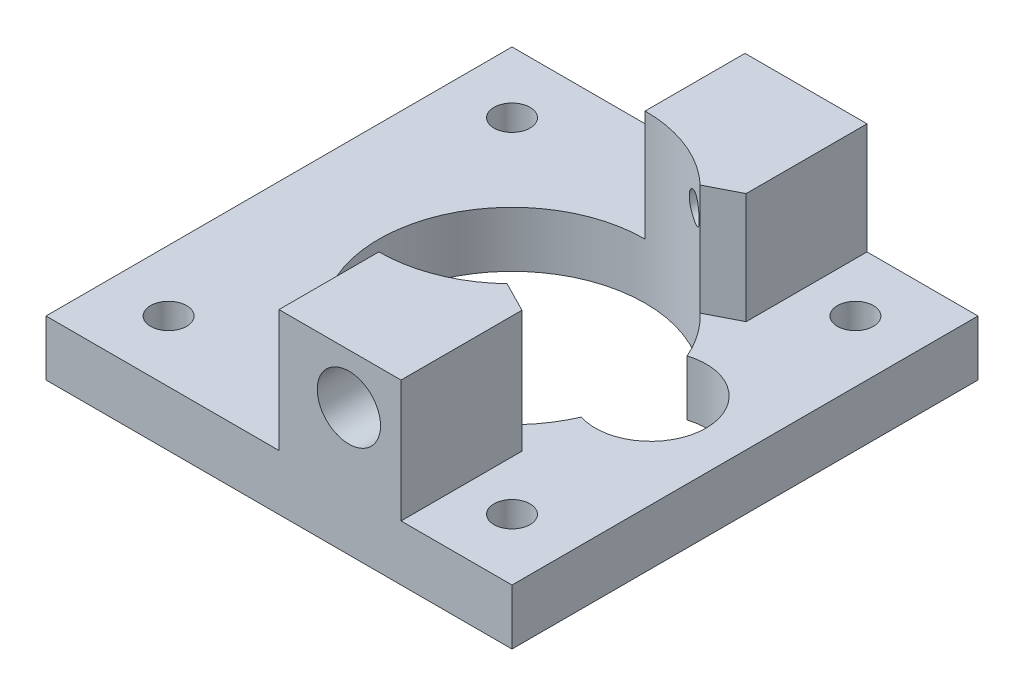
ISO-10303-21;
HEADER;
FILE_DESCRIPTION(('STEP AP214'),'2;1');
FILE_NAME('part.step','',(''),(''),'','','');
FILE_SCHEMA(('AUTOMOTIVE_DESIGN { 1 0 10303 214 1 1 1 1 }'));
ENDSEC;
DATA;
#1=APPLICATION_CONTEXT('core data for automotive mechanical design processes');
#2=APPLICATION_PROTOCOL_DEFINITION('international standard','automotive_design',2000,#1);
#3=PRODUCT_CONTEXT('',#1,'mechanical');
#4=PRODUCT('Part','Part','',(#3));
#5=PRODUCT_RELATED_PRODUCT_CATEGORY('part','',(#4));
#6=PRODUCT_DEFINITION_FORMATION('','',#4);
#7=PRODUCT_DEFINITION_CONTEXT('part definition',#1,'design');
#8=PRODUCT_DEFINITION('design','',#6,#7);
#9=PRODUCT_DEFINITION_SHAPE('','',#8);
#10=(LENGTH_UNIT() NAMED_UNIT(*) SI_UNIT(.MILLI.,.METRE.));
#11=(NAMED_UNIT(*) PLANE_ANGLE_UNIT() SI_UNIT($,.RADIAN.));
#12=(NAMED_UNIT(*) SI_UNIT($,.STERADIAN.) SOLID_ANGLE_UNIT());
#13=UNCERTAINTY_MEASURE_WITH_UNIT(LENGTH_MEASURE(1.E-05),#10,'distance_accuracy_value','');
#14=(GEOMETRIC_REPRESENTATION_CONTEXT(3) GLOBAL_UNCERTAINTY_ASSIGNED_CONTEXT((#13)) GLOBAL_UNIT_ASSIGNED_CONTEXT((#10,
#11,#12)) REPRESENTATION_CONTEXT('',''));
#15=CARTESIAN_POINT('',(0.,0.,0.));
#16=DIRECTION('',(0.,0.,1.));
#17=DIRECTION('',(1.,0.,0.));
#18=AXIS2_PLACEMENT_3D('',#15,#16,#17);
#19=CARTESIAN_POINT('',(6.29999999999999,11.5,-24.3234018715768));
#20=DIRECTION('',(0.,0.,1.));
#21=DIRECTION('',(1.,0.,0.));
#22=AXIS2_PLACEMENT_3D('',#19,#20,#21);
#23=CYLINDRICAL_SURFACE('',#22,1.175);
#24=CARTESIAN_POINT('',(7.47499999999999,11.5,9.38745838872269));
#25=CARTESIAN_POINT('',(7.47500037561036,11.4437507811066,9.3874580619095));
#26=CARTESIAN_POINT('',(7.47093573820378,11.3875033891349,9.39069895694028));
#27=CARTESIAN_POINT('',(7.45497130411184,11.2768532983478,9.40337721147673));
#28=CARTESIAN_POINT('',(7.44306841430037,11.2224513366901,9.41281701718841));
#29=CARTESIAN_POINT('',(7.4122727094978,11.1172938190168,9.43708590459081));
#30=CARTESIAN_POINT('',(7.3934163036475,11.0665208855352,9.45188690760532));
#31=CARTESIAN_POINT('',(7.34967035654355,10.9692801883149,9.48594284473265));
#32=CARTESIAN_POINT('',(7.32477888426277,10.922813809126,9.50519920432592));
#33=CARTESIAN_POINT('',(7.26754703393629,10.8309286895868,9.54904002428074));
#34=CARTESIAN_POINT('',(7.23474813129319,10.7859495130968,9.5739415629819));
#35=CARTESIAN_POINT('',(7.16425307040617,10.7020667966238,9.62680749523201));
#36=CARTESIAN_POINT('',(7.12655465793492,10.6631660715464,9.65477329769034));
#37=CARTESIAN_POINT('',(7.03878325846738,10.5840236712656,9.71900552107203));
#38=CARTESIAN_POINT('',(6.98777684641887,10.5452277036428,9.75577906113739));
#39=CARTESIAN_POINT('',(6.88120532106792,10.4768480647382,9.83124045830939));
#40=CARTESIAN_POINT('',(6.82563679981315,10.4472713609418,9.86992973777597));
#41=CARTESIAN_POINT('',(6.70095658628713,10.3930887748002,9.9550901831218));
#42=CARTESIAN_POINT('',(6.6311807374869,10.3702691876548,10.0017343169021));
#43=CARTESIAN_POINT('',(6.48849213863923,10.3379105520333,10.0948868825609));
#44=CARTESIAN_POINT('',(6.41557768507946,10.3283788118165,10.1413952257348));
#45=CARTESIAN_POINT('',(6.26346782992051,10.3229459852987,10.2360883261073));
#46=CARTESIAN_POINT('',(6.18417646096621,10.3279902907427,10.2841798593697));
#47=CARTESIAN_POINT('',(6.02651530446149,10.3544810465272,10.3773546096167));
#48=CARTESIAN_POINT('',(5.94814533403371,10.3759241842898,10.4224384321621));
#49=CARTESIAN_POINT('',(5.80015065031829,10.4338415977969,10.5054752121359));
#50=CARTESIAN_POINT('',(5.73028476847826,10.4693055306718,10.5436966289282));
#51=CARTESIAN_POINT('',(5.59724812155979,10.555010412473,10.6149186056732));
#52=CARTESIAN_POINT('',(5.53407039345135,10.6052357833348,10.6479246133816));
#53=CARTESIAN_POINT('',(5.42559337607099,10.7119361392113,10.7035586496847));
#54=CARTESIAN_POINT('',(5.37903527818813,10.7667164400501,10.7269810120016));
#55=CARTESIAN_POINT('',(5.29601113727168,10.8853022079472,10.7682134287272));
#56=CARTESIAN_POINT('',(5.25953548572142,10.9490989940849,10.7860288288007));
#57=CARTESIAN_POINT('',(5.20256881202051,11.0752044356669,10.8136098133409));
#58=CARTESIAN_POINT('',(5.18065583205767,11.1367152047945,10.8241000187399));
#59=CARTESIAN_POINT('',(5.14727165776517,11.2631293850674,10.8400157901539));
#60=CARTESIAN_POINT('',(5.13579489757456,11.3280309682643,10.8454440558497));
#61=CARTESIAN_POINT('',(5.12431187336805,11.4542016958921,10.8508738266164));
#62=CARTESIAN_POINT('',(5.12352079158136,11.5153849429973,10.8512466416488));
#63=CARTESIAN_POINT('',(5.1314244088291,11.6369895552123,10.8475113631404));
#64=CARTESIAN_POINT('',(5.14011738312642,11.6974110568294,10.8434040843336));
#65=CARTESIAN_POINT('',(5.16635680326296,11.8146831225682,10.830926125749));
#66=CARTESIAN_POINT('',(5.18374253977507,11.8715781616229,10.8226328106716));
#67=CARTESIAN_POINT('',(5.22655249370738,11.9814705824725,10.8020234252775));
#68=CARTESIAN_POINT('',(5.25197734535867,12.0344676563379,10.7897070375654));
#69=CARTESIAN_POINT('',(5.31081754299332,12.1369839659528,10.760869867597));
#70=CARTESIAN_POINT('',(5.34446540274296,12.1863345456327,10.7442256247938));
#71=CARTESIAN_POINT('',(5.41801128430791,12.2785914170407,10.7073266631582));
#72=CARTESIAN_POINT('',(5.45791094645002,12.3214960116896,10.6870709965797));
#73=CARTESIAN_POINT('',(5.5458824479816,12.4032195877325,10.6417016657962));
#74=CARTESIAN_POINT('',(5.59434585376875,12.4414754579763,10.6163349930468));
#75=CARTESIAN_POINT('',(5.69539029755836,12.5093470994993,10.5624718108427));
#76=CARTESIAN_POINT('',(5.7479730046778,12.538959345224,10.5339740307792));
#77=CARTESIAN_POINT('',(5.861787789188,12.5922303701135,10.4711086657003));
#78=CARTESIAN_POINT('',(5.92333248507643,12.6148651636975,10.4364405919522));
#79=CARTESIAN_POINT('',(6.04798325514781,12.6494793565939,10.3647035942875));
#80=CARTESIAN_POINT('',(6.11109001376997,12.6614539969245,10.3276336060051));
#81=CARTESIAN_POINT('',(6.24527726801485,12.6758960448265,10.2471147256045));
#82=CARTESIAN_POINT('',(6.31637362694875,12.676996298013,10.2034457741675));
#83=CARTESIAN_POINT('',(6.45699899992309,12.6665996443551,10.1150421556888));
#84=CARTESIAN_POINT('',(6.52652678414533,12.6550931813017,10.0703067053755));
#85=CARTESIAN_POINT('',(6.66896315293066,12.6182164668137,9.97661584742794));
#86=CARTESIAN_POINT('',(6.74156243395978,12.5916294562665,9.92766458504591));
#87=CARTESIAN_POINT('',(6.88108424791014,12.5241904245393,9.83147247575013));
#88=CARTESIAN_POINT('',(6.94800847972649,12.4833426913512,9.78423111939978));
#89=CARTESIAN_POINT('',(7.06257134243327,12.3962763712551,9.70175980896785));
#90=CARTESIAN_POINT('',(7.11150991723543,12.3523609323869,9.66590165456406));
#91=CARTESIAN_POINT('',(7.20254937585845,12.2552773262606,9.59825435036645));
#92=CARTESIAN_POINT('',(7.24465954943328,12.202121937199,9.56645968506354));
#93=CARTESIAN_POINT('',(7.3129439340035,12.0980551337812,9.51432274903214));
#94=CARTESIAN_POINT('',(7.34062571839081,12.0486510161587,9.49295284776069));
#95=CARTESIAN_POINT('',(7.38907936431073,11.9447553828823,9.45528686398682));
#96=CARTESIAN_POINT('',(7.40985679890421,11.8902680160581,9.43898668998012));
#97=CARTESIAN_POINT('',(7.4423551682127,11.7805915378061,9.41338187443222));
#98=CARTESIAN_POINT('',(7.45452247020002,11.7256170381544,9.40373324996186));
#99=CARTESIAN_POINT('',(7.47084265218716,11.6137604108939,9.39077328860187));
#100=CARTESIAN_POINT('',(7.47499962018238,11.556879271408,9.38745871919654));
#101=CARTESIAN_POINT('',(7.47499999999999,11.5,9.38745838872269));
#102=B_SPLINE_CURVE_WITH_KNOTS('',3,(#24,#25,#26,#27,#28,#29,#30,#31,#32,#33,#34,#35,#36,#37,
#38,#39,#40,#41,#42,#43,#44,#45,#46,#47,#48,#49,#50,#51,#52,#53,#54,#55,#56,#57,#58,#59,#60,#61,
#62,#63,#64,#65,#66,#67,#68,#69,#70,#71,#72,#73,#74,#75,#76,#77,#78,#79,#80,#81,#82,#83,#84,#85,
#86,#87,#88,#89,#90,#91,#92,#93,#94,#95,#96,#97,#98,#99,#100,#101),.UNSPECIFIED.,.T.,.F.,(4,2,2,
2,2,2,2,2,2,2,2,2,2,2,2,2,2,2,2,2,2,2,2,2,2,2,2,2,2,2,2,2,2,2,2,2,2,2,4),(0.,0.168514893419252,
0.33709632595878,0.504807304613788,0.672572016369988,0.854871808167711,1.03725577362463,
1.25808340076039,1.47907751663057,1.73889849392279,1.99886231534371,2.27605791252218,
2.55319753074216,2.81321741213452,3.07296386824326,3.29849562970217,3.52381171372948,
3.72116542539341,3.91841382223322,4.1010890920136,4.28373114664802,4.46311493239954,
4.64251287383508,4.82773212730998,5.01300005961671,5.21243182482231,5.41194482079294,
5.63357664929254,5.85530737071217,6.10460617034262,6.35409407557854,6.62735909341052,
6.90054201508986,7.12437632663873,7.34790351870778,7.52877745664265,7.70950503988488,
7.87999451434449,8.05039695810545),.UNSPECIFIED.);
#103=CARTESIAN_POINT('',(7.47499999999999,11.5,9.38745838872269));
#104=VERTEX_POINT('',#103);
#105=EDGE_CURVE('E217',#104,#104,#102,.T.);
#106=ORIENTED_EDGE('',*,*,#105,.T.);
#107=EDGE_LOOP('',(#106));
#108=FACE_BOUND('',#107,.T.);
#109=CARTESIAN_POINT('',(6.29999999999999,11.5,16.));
#110=DIRECTION('',(0.,0.,1.));
#111=DIRECTION('',(1.,0.,0.));
#112=AXIS2_PLACEMENT_3D('',#109,#110,#111);
#113=CIRCLE('',#112,1.175);
#114=CARTESIAN_POINT('',(7.47499999999999,11.5,16.));
#115=VERTEX_POINT('',#114);
#116=EDGE_CURVE('E51',#115,#115,#113,.F.);
#117=ORIENTED_EDGE('',*,*,#116,.F.);
#118=EDGE_LOOP('',(#117));
#119=FACE_BOUND('',#118,.T.);
#120=ADVANCED_FACE('F47',(#108,#119),#23,.F.);
#121=CARTESIAN_POINT('',(0.,5.,0.));
#122=DIRECTION('',(0.,1.,0.));
#123=DIRECTION('',(0.,0.,1.));
#124=AXIS2_PLACEMENT_3D('',#121,#122,#123);
#125=PLANE('',#124);
#126=CARTESIAN_POINT('',(-15.475,5.,15.475));
#127=DIRECTION('',(0.,1.,0.));
#128=DIRECTION('',(0.,0.,-1.));
#129=AXIS2_PLACEMENT_3D('',#126,#127,#128);
#130=CIRCLE('',#129,1.625);
#131=CARTESIAN_POINT('',(-15.475,5.,13.85));
#132=VERTEX_POINT('',#131);
#133=EDGE_CURVE('E286',#132,#132,#130,.T.);
#134=ORIENTED_EDGE('',*,*,#133,.F.);
#135=EDGE_LOOP('',(#134));
#136=FACE_BOUND('',#135,.T.);
#137=CARTESIAN_POINT('',(-15.475,5.,-15.475));
#138=DIRECTION('',(0.,1.,0.));
#139=DIRECTION('',(0.,0.,1.));
#140=AXIS2_PLACEMENT_3D('',#137,#138,#139);
#141=CIRCLE('',#140,1.625);
#142=CARTESIAN_POINT('',(-15.475,5.,-13.85));
#143=VERTEX_POINT('',#142);
#144=EDGE_CURVE('E291',#143,#143,#141,.T.);
#145=ORIENTED_EDGE('',*,*,#144,.F.);
#146=EDGE_LOOP('',(#145));
#147=FACE_BOUND('',#146,.T.);
#148=DIRECTION('',(1.,0.,0.));
#149=VECTOR('',#148,1.);
#150=CARTESIAN_POINT('',(-21.,5.,21.));
#151=LINE('',#150,#149);
#152=CARTESIAN_POINT('',(-21.,5.,21.));
#153=VERTEX_POINT('',#152);
#154=CARTESIAN_POINT('',(0.,5.,21.0000000000001));
#155=VERTEX_POINT('',#154);
#156=EDGE_CURVE('E328',#153,#155,#151,.T.);
#157=ORIENTED_EDGE('',*,*,#156,.T.);
#158=DIRECTION('',(0.,0.,1.));
#159=VECTOR('',#158,1.);
#160=CARTESIAN_POINT('',(0.,5.,12.0000000000001));
#161=LINE('',#160,#159);
#162=CARTESIAN_POINT('',(0.,5.,12.));
#163=VERTEX_POINT('',#162);
#164=EDGE_CURVE('E168',#163,#155,#161,.T.);
#165=ORIENTED_EDGE('',*,*,#164,.F.);
#166=CARTESIAN_POINT('',(0.,5.,0.));
#167=DIRECTION('',(0.,1.,0.));
#168=DIRECTION('',(0.,0.,1.));
#169=AXIS2_PLACEMENT_3D('',#166,#167,#168);
#170=CIRCLE('',#169,12.);
#171=CARTESIAN_POINT('',(0.,5.,-12.));
#172=VERTEX_POINT('',#171);
#173=EDGE_CURVE('E303',#172,#163,#170,.T.);
#174=ORIENTED_EDGE('',*,*,#173,.F.);
#175=DIRECTION('',(0.,0.,1.));
#176=VECTOR('',#175,1.);
#177=CARTESIAN_POINT('',(0.,5.,-12.));
#178=LINE('',#177,#176);
#179=CARTESIAN_POINT('',(0.,5.,-21.));
#180=VERTEX_POINT('',#179);
#181=EDGE_CURVE('E244',#180,#172,#178,.T.);
#182=ORIENTED_EDGE('',*,*,#181,.F.);
#183=DIRECTION('',(-1.,0.,0.));
#184=VECTOR('',#183,1.);
#185=CARTESIAN_POINT('',(-21.,5.,-21.));
#186=LINE('',#185,#184);
#187=CARTESIAN_POINT('',(-21.,5.,-21.));
#188=VERTEX_POINT('',#187);
#189=EDGE_CURVE('E319',#180,#188,#186,.T.);
#190=ORIENTED_EDGE('',*,*,#189,.T.);
#191=DIRECTION('',(0.,0.,1.));
#192=VECTOR('',#191,1.);
#193=CARTESIAN_POINT('',(-21.,5.,-21.));
#194=LINE('',#193,#192);
#195=EDGE_CURVE('E324',#188,#153,#194,.T.);
#196=ORIENTED_EDGE('',*,*,#195,.T.);
#197=EDGE_LOOP('',(#157,#165,#174,#182,#190,#196));
#198=FACE_BOUND('',#197,.T.);
#199=ADVANCED_FACE('F392',(#136,#147,#198),#125,.T.);
#200=CARTESIAN_POINT('',(12.5,5.,0.));
#201=DIRECTION('',(0.,1.,0.));
#202=DIRECTION('',(0.,0.,1.));
#203=AXIS2_PLACEMENT_3D('',#200,#201,#202);
#204=CIRCLE('',#203,5.);
#205=CARTESIAN_POINT('',(11.01,5.,4.77282934955777));
#206=VERTEX_POINT('',#205);
#207=CARTESIAN_POINT('',(11.01,5.,-4.77282934955777));
#208=VERTEX_POINT('',#207);
#209=EDGE_CURVE('E63',#206,#208,#204,.T.);
#210=ORIENTED_EDGE('',*,*,#209,.F.);
#211=CARTESIAN_POINT('',(8.26040454762493,5.,8.70435044730951));
#212=VERTEX_POINT('',#211);
#213=EDGE_CURVE('E308',#212,#206,#170,.T.);
#214=ORIENTED_EDGE('',*,*,#213,.F.);
#215=DIRECTION('',(-0.890650513292519,0.,-0.454688534242696));
#216=VECTOR('',#215,1.);
#217=CARTESIAN_POINT('',(8.26040454762496,5.,8.70435044730954));
#218=LINE('',#217,#216);
#219=CARTESIAN_POINT('',(11.,5.,10.1029491367702));
#220=VERTEX_POINT('',#219);
#221=EDGE_CURVE('E230',#220,#212,#218,.T.);
#222=ORIENTED_EDGE('',*,*,#221,.F.);
#223=DIRECTION('',(0.,0.,-1.));
#224=VECTOR('',#223,1.);
#225=CARTESIAN_POINT('',(11.,5.,21.));
#226=LINE('',#225,#224);
#227=CARTESIAN_POINT('',(11.,5.,21.));
#228=VERTEX_POINT('',#227);
#229=EDGE_CURVE('E233',#228,#220,#226,.T.);
#230=ORIENTED_EDGE('',*,*,#229,.F.);
#231=CARTESIAN_POINT('',(21.,5.,21.));
#232=VERTEX_POINT('',#231);
#233=EDGE_CURVE('E327',#228,#232,#151,.T.);
#234=ORIENTED_EDGE('',*,*,#233,.T.);
#235=DIRECTION('',(0.,0.,-1.));
#236=VECTOR('',#235,1.);
#237=CARTESIAN_POINT('',(21.,5.,-21.));
#238=LINE('',#237,#236);
#239=CARTESIAN_POINT('',(21.,5.,-21.));
#240=VERTEX_POINT('',#239);
#241=EDGE_CURVE('E315',#232,#240,#238,.T.);
#242=ORIENTED_EDGE('',*,*,#241,.T.);
#243=CARTESIAN_POINT('',(11.,5.,-21.));
#244=VERTEX_POINT('',#243);
#245=EDGE_CURVE('E321',#240,#244,#186,.T.);
#246=ORIENTED_EDGE('',*,*,#245,.T.);
#247=DIRECTION('',(0.,0.,-1.));
#248=VECTOR('',#247,1.);
#249=CARTESIAN_POINT('',(11.,5.,-21.));
#250=LINE('',#249,#248);
#251=CARTESIAN_POINT('',(11.,5.,-10.1029491367702));
#252=VERTEX_POINT('',#251);
#253=EDGE_CURVE('E260',#252,#244,#250,.T.);
#254=ORIENTED_EDGE('',*,*,#253,.F.);
#255=DIRECTION('',(0.890650513292519,0.,-0.454688534242698));
#256=VECTOR('',#255,1.);
#257=CARTESIAN_POINT('',(8.26040454762493,5.,-8.70435044730952));
#258=LINE('',#257,#256);
#259=CARTESIAN_POINT('',(8.26040454762493,5.,-8.70435044730952));
#260=VERTEX_POINT('',#259);
#261=EDGE_CURVE('E238',#260,#252,#258,.T.);
#262=ORIENTED_EDGE('',*,*,#261,.F.);
#263=EDGE_CURVE('E309',#208,#260,#170,.T.);
#264=ORIENTED_EDGE('',*,*,#263,.F.);
#265=EDGE_LOOP('',(#210,#214,#222,#230,#234,#242,#246,#254,#262,#264));
#266=FACE_BOUND('',#265,.T.);
#267=CARTESIAN_POINT('',(15.475,5.,-15.475));
#268=DIRECTION('',(0.,1.,0.));
#269=DIRECTION('',(0.,0.,-1.));
#270=AXIS2_PLACEMENT_3D('',#267,#268,#269);
#271=CIRCLE('',#270,1.625);
#272=CARTESIAN_POINT('',(15.475,5.,-17.1));
#273=VERTEX_POINT('',#272);
#274=EDGE_CURVE('E287',#273,#273,#271,.T.);
#275=ORIENTED_EDGE('',*,*,#274,.F.);
#276=EDGE_LOOP('',(#275));
#277=FACE_BOUND('',#276,.T.);
#278=CARTESIAN_POINT('',(15.475,5.,15.475));
#279=DIRECTION('',(0.,1.,0.));
#280=DIRECTION('',(0.,0.,1.));
#281=AXIS2_PLACEMENT_3D('',#278,#279,#280);
#282=CIRCLE('',#281,1.625);
#283=CARTESIAN_POINT('',(15.475,5.,17.1));
#284=VERTEX_POINT('',#283);
#285=EDGE_CURVE('E292',#284,#284,#282,.T.);
#286=ORIENTED_EDGE('',*,*,#285,.F.);
#287=EDGE_LOOP('',(#286));
#288=FACE_BOUND('',#287,.T.);
#289=ADVANCED_FACE('F449',(#266,#277,#288),#125,.T.);
#290=CARTESIAN_POINT('',(0.,0.,0.));
#291=DIRECTION('',(0.,1.,0.));
#292=DIRECTION('',(0.,0.,1.));
#293=AXIS2_PLACEMENT_3D('',#290,#291,#292);
#294=PLANE('',#293);
#295=CARTESIAN_POINT('',(-15.475,0.,15.475));
#296=DIRECTION('',(0.,1.,0.));
#297=DIRECTION('',(0.,0.,1.));
#298=AXIS2_PLACEMENT_3D('',#295,#296,#297);
#299=CIRCLE('',#298,1.625);
#300=CARTESIAN_POINT('',(-15.475,0.,17.1));
#301=VERTEX_POINT('',#300);
#302=EDGE_CURVE('E314',#301,#301,#299,.T.);
#303=ORIENTED_EDGE('',*,*,#302,.T.);
#304=EDGE_LOOP('',(#303));
#305=FACE_BOUND('',#304,.T.);
#306=CARTESIAN_POINT('',(15.475,0.,15.475));
#307=DIRECTION('',(0.,1.,0.));
#308=DIRECTION('',(0.,0.,1.));
#309=AXIS2_PLACEMENT_3D('',#306,#307,#308);
#310=CIRCLE('',#309,1.625);
#311=CARTESIAN_POINT('',(15.475,0.,17.1));
#312=VERTEX_POINT('',#311);
#313=EDGE_CURVE('E365',#312,#312,#310,.T.);
#314=ORIENTED_EDGE('',*,*,#313,.T.);
#315=EDGE_LOOP('',(#314));
#316=FACE_BOUND('',#315,.T.);
#317=CARTESIAN_POINT('',(15.475,0.,-15.475));
#318=DIRECTION('',(0.,1.,0.));
#319=DIRECTION('',(0.,0.,1.));
#320=AXIS2_PLACEMENT_3D('',#317,#318,#319);
#321=CIRCLE('',#320,1.625);
#322=CARTESIAN_POINT('',(15.475,0.,-13.85));
#323=VERTEX_POINT('',#322);
#324=EDGE_CURVE('E361',#323,#323,#321,.T.);
#325=ORIENTED_EDGE('',*,*,#324,.T.);
#326=EDGE_LOOP('',(#325));
#327=FACE_BOUND('',#326,.T.);
#328=CARTESIAN_POINT('',(-15.475,0.,-15.475));
#329=DIRECTION('',(0.,1.,0.));
#330=DIRECTION('',(0.,0.,1.));
#331=AXIS2_PLACEMENT_3D('',#328,#329,#330);
#332=CIRCLE('',#331,1.625);
#333=CARTESIAN_POINT('',(-15.475,0.,-13.85));
#334=VERTEX_POINT('',#333);
#335=EDGE_CURVE('E302',#334,#334,#332,.T.);
#336=ORIENTED_EDGE('',*,*,#335,.T.);
#337=EDGE_LOOP('',(#336));
#338=FACE_BOUND('',#337,.T.);
#339=DIRECTION('',(0.,0.,-1.));
#340=VECTOR('',#339,1.);
#341=CARTESIAN_POINT('',(21.,0.,-21.));
#342=LINE('',#341,#340);
#343=CARTESIAN_POINT('',(21.,0.,21.));
#344=VERTEX_POINT('',#343);
#345=CARTESIAN_POINT('',(21.,0.,-21.));
#346=VERTEX_POINT('',#345);
#347=EDGE_CURVE('E307',#344,#346,#342,.T.);
#348=ORIENTED_EDGE('',*,*,#347,.F.);
#349=DIRECTION('',(1.,0.,0.));
#350=VECTOR('',#349,1.);
#351=CARTESIAN_POINT('',(-21.,0.,21.));
#352=LINE('',#351,#350);
#353=CARTESIAN_POINT('',(-21.,0.,21.));
#354=VERTEX_POINT('',#353);
#355=EDGE_CURVE('E320',#354,#344,#352,.T.);
#356=ORIENTED_EDGE('',*,*,#355,.F.);
#357=DIRECTION('',(0.,0.,1.));
#358=VECTOR('',#357,1.);
#359=CARTESIAN_POINT('',(-21.,0.,-21.));
#360=LINE('',#359,#358);
#361=CARTESIAN_POINT('',(-21.,0.,-21.));
#362=VERTEX_POINT('',#361);
#363=EDGE_CURVE('E338',#362,#354,#360,.T.);
#364=ORIENTED_EDGE('',*,*,#363,.F.);
#365=DIRECTION('',(-1.,0.,0.));
#366=VECTOR('',#365,1.);
#367=CARTESIAN_POINT('',(-21.,0.,-21.));
#368=LINE('',#367,#366);
#369=EDGE_CURVE('E335',#346,#362,#368,.T.);
#370=ORIENTED_EDGE('',*,*,#369,.F.);
#371=EDGE_LOOP('',(#348,#356,#364,#370));
#372=FACE_BOUND('',#371,.T.);
#373=CARTESIAN_POINT('',(0.,0.,0.));
#374=DIRECTION('',(0.,1.,0.));
#375=DIRECTION('',(0.,0.,1.));
#376=AXIS2_PLACEMENT_3D('',#373,#374,#375);
#377=CIRCLE('',#376,12.);
#378=CARTESIAN_POINT('',(11.01,0.,-4.77282934955776));
#379=VERTEX_POINT('',#378);
#380=CARTESIAN_POINT('',(11.01,0.,4.77282934955776));
#381=VERTEX_POINT('',#380);
#382=EDGE_CURVE('E310',#379,#381,#377,.T.);
#383=ORIENTED_EDGE('',*,*,#382,.T.);
#384=CARTESIAN_POINT('',(12.5,0.,0.));
#385=DIRECTION('',(0.,1.,0.));
#386=DIRECTION('',(0.,0.,1.));
#387=AXIS2_PLACEMENT_3D('',#384,#385,#386);
#388=CIRCLE('',#387,5.);
#389=EDGE_CURVE('E210',#381,#379,#388,.T.);
#390=ORIENTED_EDGE('',*,*,#389,.T.);
#391=EDGE_LOOP('',(#383,#390));
#392=FACE_BOUND('',#391,.T.);
#393=ADVANCED_FACE('F446',(#305,#316,#327,#338,#372,#392),#294,.F.);
#394=CARTESIAN_POINT('',(21.,5.,-21.));
#395=DIRECTION('',(-1.,0.,0.));
#396=DIRECTION('',(0.,0.,1.));
#397=AXIS2_PLACEMENT_3D('',#394,#395,#396);
#398=PLANE('',#397);
#399=ORIENTED_EDGE('',*,*,#347,.T.);
#400=DIRECTION('',(0.,-1.,0.));
#401=VECTOR('',#400,1.);
#402=CARTESIAN_POINT('',(21.,5.,-21.));
#403=LINE('',#402,#401);
#404=EDGE_CURVE('E354',#240,#346,#403,.T.);
#405=ORIENTED_EDGE('',*,*,#404,.F.);
#406=ORIENTED_EDGE('',*,*,#241,.F.);
#407=DIRECTION('',(0.,-1.,0.));
#408=VECTOR('',#407,1.);
#409=CARTESIAN_POINT('',(21.,5.,21.));
#410=LINE('',#409,#408);
#411=EDGE_CURVE('E331',#232,#344,#410,.T.);
#412=ORIENTED_EDGE('',*,*,#411,.T.);
#413=EDGE_LOOP('',(#399,#405,#406,#412));
#414=FACE_BOUND('',#413,.T.);
#415=ADVANCED_FACE('F49',(#414),#398,.F.);
#416=CARTESIAN_POINT('',(-21.,5.,-21.));
#417=DIRECTION('',(0.,0.,1.));
#418=DIRECTION('',(1.,0.,0.));
#419=AXIS2_PLACEMENT_3D('',#416,#417,#418);
#420=PLANE('',#419);
#421=CARTESIAN_POINT('',(6.29999999999999,11.5,-21.));
#422=DIRECTION('',(0.,0.,1.));
#423=DIRECTION('',(1.,0.,0.));
#424=AXIS2_PLACEMENT_3D('',#421,#422,#423);
#425=CIRCLE('',#424,1.175);
#426=CARTESIAN_POINT('',(7.47499999999999,11.5,-21.));
#427=VERTEX_POINT('',#426);
#428=EDGE_CURVE('E214',#427,#427,#425,.F.);
#429=ORIENTED_EDGE('',*,*,#428,.F.);
#430=EDGE_LOOP('',(#429));
#431=FACE_BOUND('',#430,.T.);
#432=ORIENTED_EDGE('',*,*,#369,.T.);
#433=DIRECTION('',(0.,-1.,0.));
#434=VECTOR('',#433,1.);
#435=CARTESIAN_POINT('',(-21.,5.,-21.));
#436=LINE('',#435,#434);
#437=EDGE_CURVE('E350',#188,#362,#436,.T.);
#438=ORIENTED_EDGE('',*,*,#437,.F.);
#439=ORIENTED_EDGE('',*,*,#189,.F.);
#440=DIRECTION('',(0.,-1.,0.));
#441=VECTOR('',#440,1.);
#442=CARTESIAN_POINT('',(0.,15.,-21.));
#443=LINE('',#442,#441);
#444=CARTESIAN_POINT('',(0.,15.,-21.));
#445=VERTEX_POINT('',#444);
#446=EDGE_CURVE('E270',#445,#180,#443,.T.);
#447=ORIENTED_EDGE('',*,*,#446,.F.);
#448=DIRECTION('',(-1.,0.,0.));
#449=VECTOR('',#448,1.);
#450=CARTESIAN_POINT('',(0.,15.,-21.));
#451=LINE('',#450,#449);
#452=CARTESIAN_POINT('',(11.,15.,-21.));
#453=VERTEX_POINT('',#452);
#454=EDGE_CURVE('E250',#453,#445,#451,.T.);
#455=ORIENTED_EDGE('',*,*,#454,.F.);
#456=DIRECTION('',(0.,-1.,0.));
#457=VECTOR('',#456,1.);
#458=CARTESIAN_POINT('',(11.,15.,-21.));
#459=LINE('',#458,#457);
#460=EDGE_CURVE('E274',#453,#244,#459,.T.);
#461=ORIENTED_EDGE('',*,*,#460,.T.);
#462=ORIENTED_EDGE('',*,*,#245,.F.);
#463=ORIENTED_EDGE('',*,*,#404,.T.);
#464=EDGE_LOOP('',(#432,#438,#439,#447,#455,#461,#462,#463));
#465=FACE_BOUND('',#464,.T.);
#466=ADVANCED_FACE('F476',(#431,#465),#420,.F.);
#467=CARTESIAN_POINT('',(-21.,5.,-21.));
#468=DIRECTION('',(1.,0.,0.));
#469=DIRECTION('',(0.,0.,-1.));
#470=AXIS2_PLACEMENT_3D('',#467,#468,#469);
#471=PLANE('',#470);
#472=ORIENTED_EDGE('',*,*,#363,.T.);
#473=DIRECTION('',(0.,-1.,0.));
#474=VECTOR('',#473,1.);
#475=CARTESIAN_POINT('',(-21.,5.,21.));
#476=LINE('',#475,#474);
#477=EDGE_CURVE('E346',#153,#354,#476,.T.);
#478=ORIENTED_EDGE('',*,*,#477,.F.);
#479=ORIENTED_EDGE('',*,*,#195,.F.);
#480=ORIENTED_EDGE('',*,*,#437,.T.);
#481=EDGE_LOOP('',(#472,#478,#479,#480));
#482=FACE_BOUND('',#481,.T.);
#483=ADVANCED_FACE('F492',(#482),#471,.F.);
#484=CARTESIAN_POINT('',(-21.,5.,21.));
#485=DIRECTION('',(0.,0.,-1.));
#486=DIRECTION('',(-1.,0.,0.));
#487=AXIS2_PLACEMENT_3D('',#484,#485,#486);
#488=PLANE('',#487);
#489=CARTESIAN_POINT('',(6.29999999999999,11.5,21.));
#490=DIRECTION('',(0.,0.,1.));
#491=DIRECTION('',(1.,0.,0.));
#492=AXIS2_PLACEMENT_3D('',#489,#490,#491);
#493=CIRCLE('',#492,2.85);
#494=CARTESIAN_POINT('',(9.15,11.5,21.));
#495=VERTEX_POINT('',#494);
#496=EDGE_CURVE('E200',#495,#495,#493,.T.);
#497=ORIENTED_EDGE('',*,*,#496,.F.);
#498=EDGE_LOOP('',(#497));
#499=FACE_BOUND('',#498,.T.);
#500=ORIENTED_EDGE('',*,*,#355,.T.);
#501=ORIENTED_EDGE('',*,*,#411,.F.);
#502=ORIENTED_EDGE('',*,*,#233,.F.);
#503=DIRECTION('',(0.,-1.,0.));
#504=VECTOR('',#503,1.);
#505=CARTESIAN_POINT('',(11.,15.,21.));
#506=LINE('',#505,#504);
#507=CARTESIAN_POINT('',(11.,16.,21.));
#508=VERTEX_POINT('',#507);
#509=EDGE_CURVE('E173',#508,#228,#506,.T.);
#510=ORIENTED_EDGE('',*,*,#509,.F.);
#511=DIRECTION('',(1.,0.,0.));
#512=VECTOR('',#511,1.);
#513=CARTESIAN_POINT('',(0.,16.,21.0000000000001));
#514=LINE('',#513,#512);
#515=CARTESIAN_POINT('',(0.,16.,21.0000000000001));
#516=VERTEX_POINT('',#515);
#517=EDGE_CURVE('E177',#516,#508,#514,.T.);
#518=ORIENTED_EDGE('',*,*,#517,.F.);
#519=DIRECTION('',(0.,-1.,0.));
#520=VECTOR('',#519,1.);
#521=CARTESIAN_POINT('',(0.,15.,21.0000000000001));
#522=LINE('',#521,#520);
#523=EDGE_CURVE('E162',#516,#155,#522,.T.);
#524=ORIENTED_EDGE('',*,*,#523,.T.);
#525=ORIENTED_EDGE('',*,*,#156,.F.);
#526=ORIENTED_EDGE('',*,*,#477,.T.);
#527=EDGE_LOOP('',(#500,#501,#502,#510,#518,#524,#525,#526));
#528=FACE_BOUND('',#527,.T.);
#529=ADVANCED_FACE('F178',(#499,#528),#488,.F.);
#530=CARTESIAN_POINT('',(0.,5.,0.));
#531=DIRECTION('',(0.,-1.,0.));
#532=DIRECTION('',(0.,0.,-1.));
#533=AXIS2_PLACEMENT_3D('',#530,#531,#532);
#534=CYLINDRICAL_SURFACE('',#533,12.);
#535=DIRECTION('',(0.,1.,0.));
#536=VECTOR('',#535,1.);
#537=CARTESIAN_POINT('',(11.01,0.,4.77282934955776));
#538=LINE('',#537,#536);
#539=EDGE_CURVE('E11',#381,#206,#538,.T.);
#540=ORIENTED_EDGE('',*,*,#539,.F.);
#541=ORIENTED_EDGE('',*,*,#382,.F.);
#542=DIRECTION('',(0.,1.,0.));
#543=VECTOR('',#542,1.);
#544=CARTESIAN_POINT('',(11.01,0.,-4.77282934955777));
#545=LINE('',#544,#543);
#546=EDGE_CURVE('E57',#208,#379,#545,.F.);
#547=ORIENTED_EDGE('',*,*,#546,.F.);
#548=ORIENTED_EDGE('',*,*,#263,.T.);
#549=DIRECTION('',(0.,-1.,0.));
#550=VECTOR('',#549,1.);
#551=CARTESIAN_POINT('',(8.26040454762493,15.,-8.70435044730952));
#552=LINE('',#551,#550);
#553=CARTESIAN_POINT('',(8.26040454762493,15.,-8.70435044730952));
#554=VERTEX_POINT('',#553);
#555=EDGE_CURVE('E282',#554,#260,#552,.T.);
#556=ORIENTED_EDGE('',*,*,#555,.F.);
#557=CARTESIAN_POINT('',(0.,15.,0.));
#558=DIRECTION('',(0.,-1.,0.));
#559=DIRECTION('',(0.,0.,-1.));
#560=AXIS2_PLACEMENT_3D('',#557,#558,#559);
#561=CIRCLE('',#560,12.);
#562=CARTESIAN_POINT('',(0.,15.,-12.));
#563=VERTEX_POINT('',#562);
#564=EDGE_CURVE('E239',#563,#554,#561,.T.);
#565=ORIENTED_EDGE('',*,*,#564,.F.);
#566=DIRECTION('',(0.,-1.,0.));
#567=VECTOR('',#566,1.);
#568=CARTESIAN_POINT('',(0.,15.,-12.));
#569=LINE('',#568,#567);
#570=EDGE_CURVE('E256',#563,#172,#569,.T.);
#571=ORIENTED_EDGE('',*,*,#570,.T.);
#572=ORIENTED_EDGE('',*,*,#173,.T.);
#573=DIRECTION('',(0.,-1.,0.));
#574=VECTOR('',#573,1.);
#575=CARTESIAN_POINT('',(0.,15.,12.));
#576=LINE('',#575,#574);
#577=CARTESIAN_POINT('',(0.,16.,12.));
#578=VERTEX_POINT('',#577);
#579=EDGE_CURVE('E227',#578,#163,#576,.T.);
#580=ORIENTED_EDGE('',*,*,#579,.F.);
#581=CARTESIAN_POINT('',(1.13624387676481E-13,16.,4.92661467177413E-13));
#582=DIRECTION('',(0.,-1.,0.));
#583=DIRECTION('',(0.,0.,1.));
#584=AXIS2_PLACEMENT_3D('',#581,#582,#583);
#585=CIRCLE('',#584,11.9999999999996);
#586=CARTESIAN_POINT('',(8.26040454762493,16.,8.70435044730951));
#587=VERTEX_POINT('',#586);
#588=EDGE_CURVE('E189',#587,#578,#585,.T.);
#589=ORIENTED_EDGE('',*,*,#588,.F.);
#590=DIRECTION('',(0.,-1.,0.));
#591=VECTOR('',#590,1.);
#592=CARTESIAN_POINT('',(8.26040454762496,15.,8.70435044730954));
#593=LINE('',#592,#591);
#594=EDGE_CURVE('E71',#587,#212,#593,.T.);
#595=ORIENTED_EDGE('',*,*,#594,.T.);
#596=ORIENTED_EDGE('',*,*,#213,.T.);
#597=EDGE_LOOP('',(#540,#541,#547,#548,#556,#565,#571,#572,#580,#589,#595,#596));
#598=FACE_BOUND('',#597,.T.);
#599=CARTESIAN_POINT('',(7.47499999999999,11.5,-9.3874583887227));
#600=CARTESIAN_POINT('',(7.47500037561036,11.5562492188934,-9.38745806190951));
#601=CARTESIAN_POINT('',(7.47093573820378,11.6124966108651,-9.39069895694029));
#602=CARTESIAN_POINT('',(7.45497130411184,11.7231467016522,-9.40337721147674));
#603=CARTESIAN_POINT('',(7.44306841430037,11.7775486633099,-9.41281701718843));
#604=CARTESIAN_POINT('',(7.4122727094978,11.8827061809832,-9.43708590459082));
#605=CARTESIAN_POINT('',(7.3934163036475,11.9334791144648,-9.45188690760533));
#606=CARTESIAN_POINT('',(7.34967035654355,12.0307198116851,-9.48594284473266));
#607=CARTESIAN_POINT('',(7.32477888426277,12.077186190874,-9.50519920432594));
#608=CARTESIAN_POINT('',(7.26754703393629,12.1690713104132,-9.54904002428075));
#609=CARTESIAN_POINT('',(7.23474813129319,12.2140504869032,-9.57394156298191));
#610=CARTESIAN_POINT('',(7.16425307040617,12.2979332033762,-9.62680749523203));
#611=CARTESIAN_POINT('',(7.12655465793492,12.3368339284536,-9.65477329769035));
#612=CARTESIAN_POINT('',(7.03878325846738,12.4159763287344,-9.71900552107204));
#613=CARTESIAN_POINT('',(6.98777684641887,12.4547722963572,-9.7557790611374));
#614=CARTESIAN_POINT('',(6.88120532106792,12.5231519352618,-9.8312404583094));
#615=CARTESIAN_POINT('',(6.82563679981315,12.5527286390582,-9.86992973777598));
#616=CARTESIAN_POINT('',(6.70095658628713,12.6069112251998,-9.95509018312181));
#617=CARTESIAN_POINT('',(6.6311807374869,12.6297308123452,-10.0017343169022));
#618=CARTESIAN_POINT('',(6.48849213863923,12.6620894479667,-10.094886882561));
#619=CARTESIAN_POINT('',(6.41557768507946,12.6716211881835,-10.1413952257349));
#620=CARTESIAN_POINT('',(6.26346782992051,12.6770540147013,-10.2360883261073));
#621=CARTESIAN_POINT('',(6.18417646096621,12.6720097092573,-10.2841798593697));
#622=CARTESIAN_POINT('',(6.02651530446149,12.6455189534728,-10.3773546096168));
#623=CARTESIAN_POINT('',(5.94814533403371,12.6240758157102,-10.4224384321621));
#624=CARTESIAN_POINT('',(5.80015065031829,12.5661584022031,-10.505475212136));
#625=CARTESIAN_POINT('',(5.73028476847826,12.5306944693282,-10.5436966289282));
#626=CARTESIAN_POINT('',(5.59724812155979,12.444989587527,-10.6149186056732));
#627=CARTESIAN_POINT('',(5.53407039345135,12.3947642166652,-10.6479246133816));
#628=CARTESIAN_POINT('',(5.42559337607099,12.2880638607887,-10.7035586496847));
#629=CARTESIAN_POINT('',(5.37903527818813,12.2332835599499,-10.7269810120017));
#630=CARTESIAN_POINT('',(5.29601113727168,12.1146977920528,-10.7682134287272));
#631=CARTESIAN_POINT('',(5.25953548572142,12.0509010059151,-10.7860288288007));
#632=CARTESIAN_POINT('',(5.20256881202051,11.9247955643331,-10.8136098133409));
#633=CARTESIAN_POINT('',(5.18065583205768,11.8632847952055,-10.8241000187399));
#634=CARTESIAN_POINT('',(5.14727165776517,11.7368706149326,-10.8400157901539));
#635=CARTESIAN_POINT('',(5.13579489757456,11.6719690317357,-10.8454440558497));
#636=CARTESIAN_POINT('',(5.12431187336805,11.5457983041079,-10.8508738266164));
#637=CARTESIAN_POINT('',(5.12352079158136,11.4846150570027,-10.8512466416489));
#638=CARTESIAN_POINT('',(5.1314244088291,11.3630104447877,-10.8475113631404));
#639=CARTESIAN_POINT('',(5.14011738312642,11.3025889431706,-10.8434040843337));
#640=CARTESIAN_POINT('',(5.16635680326296,11.1853168774318,-10.830926125749));
#641=CARTESIAN_POINT('',(5.18374253977507,11.1284218383771,-10.8226328106716));
#642=CARTESIAN_POINT('',(5.22655249370738,11.0185294175275,-10.8020234252775));
#643=CARTESIAN_POINT('',(5.25197734535867,10.9655323436621,-10.7897070375654));
#644=CARTESIAN_POINT('',(5.31081754299332,10.8630160340472,-10.760869867597));
#645=CARTESIAN_POINT('',(5.34446540274296,10.8136654543673,-10.7442256247939));
#646=CARTESIAN_POINT('',(5.41801128430791,10.7214085829593,-10.7073266631583));
#647=CARTESIAN_POINT('',(5.45791094645002,10.6785039883104,-10.6870709965797));
#648=CARTESIAN_POINT('',(5.5458824479816,10.5967804122675,-10.6417016657962));
#649=CARTESIAN_POINT('',(5.59434585376875,10.5585245420237,-10.6163349930468));
#650=CARTESIAN_POINT('',(5.69539029755837,10.4906529005007,-10.5624718108427));
#651=CARTESIAN_POINT('',(5.7479730046778,10.461040654776,-10.5339740307793));
#652=CARTESIAN_POINT('',(5.861787789188,10.4077696298865,-10.4711086657003));
#653=CARTESIAN_POINT('',(5.92333248507643,10.3851348363025,-10.4364405919522));
#654=CARTESIAN_POINT('',(6.04798325514781,10.3505206434061,-10.3647035942875));
#655=CARTESIAN_POINT('',(6.11109001376997,10.3385460030755,-10.3276336060051));
#656=CARTESIAN_POINT('',(6.24527726801485,10.3241039551735,-10.2471147256045));
#657=CARTESIAN_POINT('',(6.31637362694875,10.323003701987,-10.2034457741675));
#658=CARTESIAN_POINT('',(6.45699899992309,10.3334003556449,-10.1150421556888));
#659=CARTESIAN_POINT('',(6.52652678414533,10.3449068186983,-10.0703067053755));
#660=CARTESIAN_POINT('',(6.66896315293066,10.3817835331863,-9.97661584742796));
#661=CARTESIAN_POINT('',(6.74156243395978,10.4083705437335,-9.92766458504592));
#662=CARTESIAN_POINT('',(6.88108424791014,10.4758095754607,-9.83147247575014));
#663=CARTESIAN_POINT('',(6.94800847972649,10.5166573086488,-9.78423111939979));
#664=CARTESIAN_POINT('',(7.06257134243327,10.6037236287449,-9.70175980896786));
#665=CARTESIAN_POINT('',(7.11150991723544,10.6476390676131,-9.66590165456407));
#666=CARTESIAN_POINT('',(7.20254937585845,10.7447226737394,-9.59825435036646));
#667=CARTESIAN_POINT('',(7.24465954943328,10.797878062801,-9.56645968506355));
#668=CARTESIAN_POINT('',(7.3129439340035,10.9019448662188,-9.51432274903215));
#669=CARTESIAN_POINT('',(7.34062571839081,10.9513489838413,-9.4929528477607));
#670=CARTESIAN_POINT('',(7.38907936431073,11.0552446171177,-9.45528686398683));
#671=CARTESIAN_POINT('',(7.40985679890421,11.1097319839419,-9.43898668998013));
#672=CARTESIAN_POINT('',(7.4423551682127,11.2194084621939,-9.41338187443223));
#673=CARTESIAN_POINT('',(7.45452247020002,11.2743829618456,-9.40373324996187));
#674=CARTESIAN_POINT('',(7.47084265218716,11.3862395891061,-9.39077328860189));
#675=CARTESIAN_POINT('',(7.47499962018238,11.443120728592,-9.38745871919656));
#676=CARTESIAN_POINT('',(7.47499999999999,11.5,-9.3874583887227));
#677=B_SPLINE_CURVE_WITH_KNOTS('',3,(#599,#600,#601,#602,#603,#604,#605,#606,#607,#608,#609,
#610,#611,#612,#613,#614,#615,#616,#617,#618,#619,#620,#621,#622,#623,#624,#625,#626,#627,#628,
#629,#630,#631,#632,#633,#634,#635,#636,#637,#638,#639,#640,#641,#642,#643,#644,#645,#646,#647,
#648,#649,#650,#651,#652,#653,#654,#655,#656,#657,#658,#659,#660,#661,#662,#663,#664,#665,#666,
#667,#668,#669,#670,#671,#672,#673,#674,#675,#676),.UNSPECIFIED.,.T.,.F.,(4,2,2,2,2,2,2,2,2,2,2,
2,2,2,2,2,2,2,2,2,2,2,2,2,2,2,2,2,2,2,2,2,2,2,2,2,2,2,4),(0.,0.168514893419254,0.33709632595878,
0.504807304613792,0.672572016369988,0.85487180816771,1.03725577362463,1.25808340076039,
1.47907751663057,1.73889849392279,1.99886231534371,2.27605791252218,2.55319753074216,
2.81321741213452,3.07296386824326,3.29849562970217,3.52381171372948,3.72116542539341,
3.91841382223322,4.10108909201359,4.28373114664802,4.46311493239955,4.64251287383508,
4.82773212730998,5.01300005961671,5.21243182482231,5.41194482079294,5.63357664929253,
5.85530737071217,6.10460617034262,6.35409407557854,6.62735909341051,6.90054201508986,
7.12437632663873,7.34790351870778,7.52877745664265,7.70950503988488,7.87999451434449,
8.05039695810545),.UNSPECIFIED.);
#678=CARTESIAN_POINT('',(7.47499999999999,11.5,-9.3874583887227));
#679=VERTEX_POINT('',#678);
#680=EDGE_CURVE('E174',#679,#679,#677,.T.);
#681=ORIENTED_EDGE('',*,*,#680,.F.);
#682=EDGE_LOOP('',(#681));
#683=FACE_BOUND('',#682,.T.);
#684=ORIENTED_EDGE('',*,*,#105,.F.);
#685=EDGE_LOOP('',(#684));
#686=FACE_BOUND('',#685,.T.);
#687=ADVANCED_FACE('F384',(#598,#683,#686),#534,.F.);
#688=CARTESIAN_POINT('',(-15.475,-3.,-15.475));
#689=DIRECTION('',(0.,1.,0.));
#690=DIRECTION('',(0.,0.,1.));
#691=AXIS2_PLACEMENT_3D('',#688,#689,#690);
#692=CYLINDRICAL_SURFACE('',#691,1.625);
#693=ORIENTED_EDGE('',*,*,#144,.T.);
#694=EDGE_LOOP('',(#693));
#695=FACE_BOUND('',#694,.T.);
#696=ORIENTED_EDGE('',*,*,#335,.F.);
#697=EDGE_LOOP('',(#696));
#698=FACE_BOUND('',#697,.T.);
#699=ADVANCED_FACE('F429',(#695,#698),#692,.F.);
#700=CARTESIAN_POINT('',(15.475,-3.,-15.475));
#701=DIRECTION('',(0.,1.,0.));
#702=DIRECTION('',(0.,0.,1.));
#703=AXIS2_PLACEMENT_3D('',#700,#701,#702);
#704=CYLINDRICAL_SURFACE('',#703,1.625);
#705=ORIENTED_EDGE('',*,*,#274,.T.);
#706=EDGE_LOOP('',(#705));
#707=FACE_BOUND('',#706,.T.);
#708=ORIENTED_EDGE('',*,*,#324,.F.);
#709=EDGE_LOOP('',(#708));
#710=FACE_BOUND('',#709,.T.);
#711=ADVANCED_FACE('F425',(#707,#710),#704,.F.);
#712=CARTESIAN_POINT('',(15.475,-3.,15.475));
#713=DIRECTION('',(0.,1.,0.));
#714=DIRECTION('',(0.,0.,1.));
#715=AXIS2_PLACEMENT_3D('',#712,#713,#714);
#716=CYLINDRICAL_SURFACE('',#715,1.625);
#717=ORIENTED_EDGE('',*,*,#285,.T.);
#718=EDGE_LOOP('',(#717));
#719=FACE_BOUND('',#718,.T.);
#720=ORIENTED_EDGE('',*,*,#313,.F.);
#721=EDGE_LOOP('',(#720));
#722=FACE_BOUND('',#721,.T.);
#723=ADVANCED_FACE('F428',(#719,#722),#716,.F.);
#724=CARTESIAN_POINT('',(-15.475,-3.,15.475));
#725=DIRECTION('',(0.,1.,0.));
#726=DIRECTION('',(0.,0.,1.));
#727=AXIS2_PLACEMENT_3D('',#724,#725,#726);
#728=CYLINDRICAL_SURFACE('',#727,1.625);
#729=ORIENTED_EDGE('',*,*,#133,.T.);
#730=EDGE_LOOP('',(#729));
#731=FACE_BOUND('',#730,.T.);
#732=ORIENTED_EDGE('',*,*,#302,.F.);
#733=EDGE_LOOP('',(#732));
#734=FACE_BOUND('',#733,.T.);
#735=ADVANCED_FACE('F423',(#731,#734),#728,.F.);
#736=CARTESIAN_POINT('',(8.26040454762493,15.,-8.70435044730952));
#737=DIRECTION('',(-0.454688534242698,0.,-0.890650513292519));
#738=DIRECTION('',(-0.890650513292519,0.,0.454688534242698));
#739=AXIS2_PLACEMENT_3D('',#736,#737,#738);
#740=PLANE('',#739);
#741=ORIENTED_EDGE('',*,*,#261,.T.);
#742=DIRECTION('',(0.,-1.,0.));
#743=VECTOR('',#742,1.);
#744=CARTESIAN_POINT('',(11.,15.,-10.1029491367702));
#745=LINE('',#744,#743);
#746=CARTESIAN_POINT('',(11.,15.,-10.1029491367702));
#747=VERTEX_POINT('',#746);
#748=EDGE_CURVE('E278',#747,#252,#745,.T.);
#749=ORIENTED_EDGE('',*,*,#748,.F.);
#750=DIRECTION('',(0.890650513292519,0.,-0.454688534242698));
#751=VECTOR('',#750,1.);
#752=CARTESIAN_POINT('',(8.26040454762493,15.,-8.70435044730952));
#753=LINE('',#752,#751);
#754=EDGE_CURVE('E243',#554,#747,#753,.T.);
#755=ORIENTED_EDGE('',*,*,#754,.F.);
#756=ORIENTED_EDGE('',*,*,#555,.T.);
#757=EDGE_LOOP('',(#741,#749,#755,#756));
#758=FACE_BOUND('',#757,.T.);
#759=ADVANCED_FACE('F419',(#758),#740,.F.);
#760=CARTESIAN_POINT('',(11.,15.,-21.));
#761=DIRECTION('',(-1.,0.,0.));
#762=DIRECTION('',(0.,0.,1.));
#763=AXIS2_PLACEMENT_3D('',#760,#761,#762);
#764=PLANE('',#763);
#765=ORIENTED_EDGE('',*,*,#253,.T.);
#766=ORIENTED_EDGE('',*,*,#460,.F.);
#767=DIRECTION('',(0.,0.,-1.));
#768=VECTOR('',#767,1.);
#769=CARTESIAN_POINT('',(11.,15.,-21.));
#770=LINE('',#769,#768);
#771=EDGE_CURVE('E247',#747,#453,#770,.T.);
#772=ORIENTED_EDGE('',*,*,#771,.F.);
#773=ORIENTED_EDGE('',*,*,#748,.T.);
#774=EDGE_LOOP('',(#765,#766,#772,#773));
#775=FACE_BOUND('',#774,.T.);
#776=ADVANCED_FACE('F415',(#775),#764,.F.);
#777=CARTESIAN_POINT('',(0.,15.,-12.));
#778=DIRECTION('',(1.,0.,0.));
#779=DIRECTION('',(0.,0.,-1.));
#780=AXIS2_PLACEMENT_3D('',#777,#778,#779);
#781=PLANE('',#780);
#782=ORIENTED_EDGE('',*,*,#181,.T.);
#783=ORIENTED_EDGE('',*,*,#570,.F.);
#784=DIRECTION('',(0.,0.,1.));
#785=VECTOR('',#784,1.);
#786=CARTESIAN_POINT('',(0.,15.,-12.));
#787=LINE('',#786,#785);
#788=EDGE_CURVE('E253',#445,#563,#787,.T.);
#789=ORIENTED_EDGE('',*,*,#788,.F.);
#790=ORIENTED_EDGE('',*,*,#446,.T.);
#791=EDGE_LOOP('',(#782,#783,#789,#790));
#792=FACE_BOUND('',#791,.T.);
#793=ADVANCED_FACE('F411',(#792),#781,.F.);
#794=CARTESIAN_POINT('',(0.,15.,0.));
#795=DIRECTION('',(0.,-1.,0.));
#796=DIRECTION('',(0.,0.,-1.));
#797=AXIS2_PLACEMENT_3D('',#794,#795,#796);
#798=PLANE('',#797);
#799=ORIENTED_EDGE('',*,*,#564,.T.);
#800=ORIENTED_EDGE('',*,*,#754,.T.);
#801=ORIENTED_EDGE('',*,*,#771,.T.);
#802=ORIENTED_EDGE('',*,*,#454,.T.);
#803=ORIENTED_EDGE('',*,*,#788,.T.);
#804=EDGE_LOOP('',(#799,#800,#801,#802,#803));
#805=FACE_BOUND('',#804,.T.);
#806=ADVANCED_FACE('F401',(#805),#798,.F.);
#807=CARTESIAN_POINT('',(0.,15.,12.0000000000001));
#808=DIRECTION('',(1.,0.,0.));
#809=DIRECTION('',(0.,0.,-1.));
#810=AXIS2_PLACEMENT_3D('',#807,#808,#809);
#811=PLANE('',#810);
#812=ORIENTED_EDGE('',*,*,#164,.T.);
#813=ORIENTED_EDGE('',*,*,#523,.F.);
#814=DIRECTION('',(0.,0.,1.));
#815=VECTOR('',#814,1.);
#816=CARTESIAN_POINT('',(0.,16.,21.0000000000001));
#817=LINE('',#816,#815);
#818=EDGE_CURVE('E166',#578,#516,#817,.T.);
#819=ORIENTED_EDGE('',*,*,#818,.F.);
#820=ORIENTED_EDGE('',*,*,#579,.T.);
#821=EDGE_LOOP('',(#812,#813,#819,#820));
#822=FACE_BOUND('',#821,.T.);
#823=ADVANCED_FACE('F164',(#822),#811,.F.);
#824=CARTESIAN_POINT('',(11.,15.,21.));
#825=DIRECTION('',(-1.,0.,0.));
#826=DIRECTION('',(0.,0.,1.));
#827=AXIS2_PLACEMENT_3D('',#824,#825,#826);
#828=PLANE('',#827);
#829=ORIENTED_EDGE('',*,*,#229,.T.);
#830=DIRECTION('',(0.,-1.,0.));
#831=VECTOR('',#830,1.);
#832=CARTESIAN_POINT('',(11.,15.,10.1029491367702));
#833=LINE('',#832,#831);
#834=CARTESIAN_POINT('',(11.,16.,10.1029491367702));
#835=VERTEX_POINT('',#834);
#836=EDGE_CURVE('E221',#835,#220,#833,.T.);
#837=ORIENTED_EDGE('',*,*,#836,.F.);
#838=DIRECTION('',(0.,0.,-1.));
#839=VECTOR('',#838,1.);
#840=CARTESIAN_POINT('',(11.,16.,21.));
#841=LINE('',#840,#839);
#842=EDGE_CURVE('E184',#508,#835,#841,.T.);
#843=ORIENTED_EDGE('',*,*,#842,.F.);
#844=ORIENTED_EDGE('',*,*,#509,.T.);
#845=EDGE_LOOP('',(#829,#837,#843,#844));
#846=FACE_BOUND('',#845,.T.);
#847=ADVANCED_FACE('F400',(#846),#828,.F.);
#848=CARTESIAN_POINT('',(8.26040454762496,15.,8.70435044730954));
#849=DIRECTION('',(-0.454688534242697,0.,0.890650513292519));
#850=DIRECTION('',(0.89065051329252,0.,0.454688534242697));
#851=AXIS2_PLACEMENT_3D('',#848,#849,#850);
#852=PLANE('',#851);
#853=ORIENTED_EDGE('',*,*,#221,.T.);
#854=ORIENTED_EDGE('',*,*,#594,.F.);
#855=DIRECTION('',(-0.890650513292517,0.,-0.454688534242701));
#856=VECTOR('',#855,1.);
#857=CARTESIAN_POINT('',(11.,16.,10.1029491367702));
#858=LINE('',#857,#856);
#859=EDGE_CURVE('E195',#835,#587,#858,.T.);
#860=ORIENTED_EDGE('',*,*,#859,.F.);
#861=ORIENTED_EDGE('',*,*,#836,.T.);
#862=EDGE_LOOP('',(#853,#854,#860,#861));
#863=FACE_BOUND('',#862,.T.);
#864=ADVANCED_FACE('F404',(#863),#852,.F.);
#865=ORIENTED_EDGE('',*,*,#680,.T.);
#866=EDGE_LOOP('',(#865));
#867=FACE_BOUND('',#866,.T.);
#868=ORIENTED_EDGE('',*,*,#428,.T.);
#869=EDGE_LOOP('',(#868));
#870=FACE_BOUND('',#869,.T.);
#871=ADVANCED_FACE('F394',(#867,#870),#23,.F.);
#872=CARTESIAN_POINT('',(12.5,-5.,0.));
#873=DIRECTION('',(0.,1.,0.));
#874=DIRECTION('',(0.,0.,1.));
#875=AXIS2_PLACEMENT_3D('',#872,#873,#874);
#876=CYLINDRICAL_SURFACE('',#875,5.);
#877=ORIENTED_EDGE('',*,*,#539,.T.);
#878=ORIENTED_EDGE('',*,*,#209,.T.);
#879=ORIENTED_EDGE('',*,*,#546,.T.);
#880=ORIENTED_EDGE('',*,*,#389,.F.);
#881=EDGE_LOOP('',(#877,#878,#879,#880));
#882=FACE_BOUND('',#881,.T.);
#883=ADVANCED_FACE('F395',(#882),#876,.F.);
#884=CARTESIAN_POINT('',(6.29999999999999,11.5,16.));
#885=DIRECTION('',(0.,0.,1.));
#886=DIRECTION('',(1.,0.,0.));
#887=AXIS2_PLACEMENT_3D('',#884,#885,#886);
#888=PLANE('',#887);
#889=CARTESIAN_POINT('',(6.29999999999999,11.5,16.));
#890=DIRECTION('',(0.,0.,1.));
#891=DIRECTION('',(1.,0.,0.));
#892=AXIS2_PLACEMENT_3D('',#889,#890,#891);
#893=CIRCLE('',#892,2.85);
#894=CARTESIAN_POINT('',(9.15,11.5,16.));
#895=VERTEX_POINT('',#894);
#896=EDGE_CURVE('E201',#895,#895,#893,.T.);
#897=ORIENTED_EDGE('',*,*,#896,.T.);
#898=EDGE_LOOP('',(#897));
#899=FACE_BOUND('',#898,.T.);
#900=ORIENTED_EDGE('',*,*,#116,.T.);
#901=EDGE_LOOP('',(#900));
#902=FACE_BOUND('',#901,.T.);
#903=ADVANCED_FACE('F534',(#899,#902),#888,.T.);
#904=CARTESIAN_POINT('',(6.29999999999999,11.5,16.));
#905=DIRECTION('',(0.,0.,1.));
#906=DIRECTION('',(1.,0.,0.));
#907=AXIS2_PLACEMENT_3D('',#904,#905,#906);
#908=CYLINDRICAL_SURFACE('',#907,2.85);
#909=ORIENTED_EDGE('',*,*,#896,.F.);
#910=EDGE_LOOP('',(#909));
#911=FACE_BOUND('',#910,.T.);
#912=ORIENTED_EDGE('',*,*,#496,.T.);
#913=EDGE_LOOP('',(#912));
#914=FACE_BOUND('',#913,.T.);
#915=ADVANCED_FACE('F547',(#911,#914),#908,.F.);
#916=CARTESIAN_POINT('',(1.13624387676481E-13,16.,4.92661467177413E-13));
#917=DIRECTION('',(0.,1.,0.));
#918=DIRECTION('',(0.,0.,1.));
#919=AXIS2_PLACEMENT_3D('',#916,#917,#918);
#920=PLANE('',#919);
#921=ORIENTED_EDGE('',*,*,#818,.T.);
#922=ORIENTED_EDGE('',*,*,#517,.T.);
#923=ORIENTED_EDGE('',*,*,#842,.T.);
#924=ORIENTED_EDGE('',*,*,#859,.T.);
#925=ORIENTED_EDGE('',*,*,#588,.T.);
#926=EDGE_LOOP('',(#921,#922,#923,#924,#925));
#927=FACE_BOUND('',#926,.T.);
#928=ADVANCED_FACE('F187',(#927),#920,.T.);
#929=CLOSED_SHELL('',(#120,#199,#289,#393,#415,#466,#483,#529,#687,#699,#711,#723,#735,#759,
#776,#793,#806,#823,#847,#864,#871,#883,#903,#915,#928));
#930=MANIFOLD_SOLID_BREP('B2',#929);
#931=ADVANCED_BREP_SHAPE_REPRESENTATION('',(#18,#930),#14);
#932=SHAPE_DEFINITION_REPRESENTATION(#9,#931);
ENDSEC;
END-ISO-10303-21;
